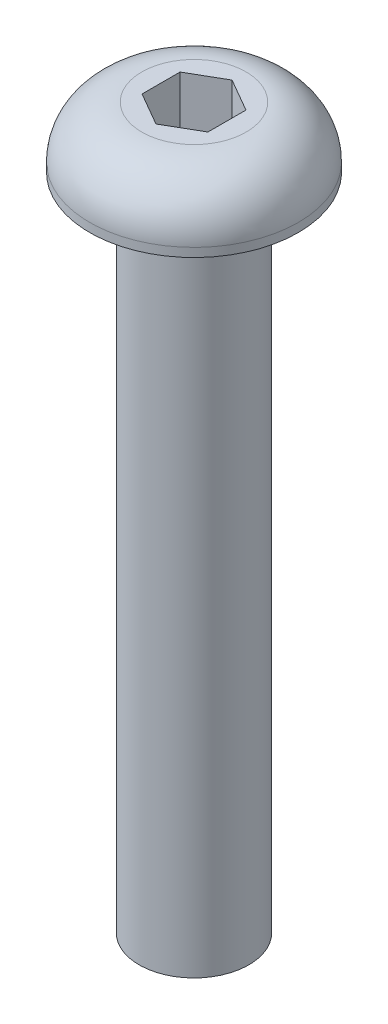
ISO-10303-21;
HEADER;
FILE_DESCRIPTION(('STEP AP214'),'2;1');
FILE_NAME('part.step','',(''),(''),'','','');
FILE_SCHEMA(('AUTOMOTIVE_DESIGN { 1 0 10303 214 1 1 1 1 }'));
ENDSEC;
DATA;
#1=APPLICATION_CONTEXT('core data for automotive mechanical design processes');
#2=APPLICATION_PROTOCOL_DEFINITION('international standard','automotive_design',2000,#1);
#3=PRODUCT_CONTEXT('',#1,'mechanical');
#4=PRODUCT('Part','Part','',(#3));
#5=PRODUCT_RELATED_PRODUCT_CATEGORY('part','',(#4));
#6=PRODUCT_DEFINITION_FORMATION('','',#4);
#7=PRODUCT_DEFINITION_CONTEXT('part definition',#1,'design');
#8=PRODUCT_DEFINITION('design','',#6,#7);
#9=PRODUCT_DEFINITION_SHAPE('','',#8);
#10=(LENGTH_UNIT() NAMED_UNIT(*) SI_UNIT(.MILLI.,.METRE.));
#11=(NAMED_UNIT(*) PLANE_ANGLE_UNIT() SI_UNIT($,.RADIAN.));
#12=(NAMED_UNIT(*) SI_UNIT($,.STERADIAN.) SOLID_ANGLE_UNIT());
#13=UNCERTAINTY_MEASURE_WITH_UNIT(LENGTH_MEASURE(1.E-05),#10,'distance_accuracy_value','');
#14=(GEOMETRIC_REPRESENTATION_CONTEXT(3) GLOBAL_UNCERTAINTY_ASSIGNED_CONTEXT((#13)) GLOBAL_UNIT_ASSIGNED_CONTEXT((#10,
#11,#12)) REPRESENTATION_CONTEXT('',''));
#15=CARTESIAN_POINT('',(0.,0.,0.));
#16=DIRECTION('',(0.,0.,1.));
#17=DIRECTION('',(1.,0.,0.));
#18=AXIS2_PLACEMENT_3D('',#15,#16,#17);
#19=CARTESIAN_POINT('',(2.375,32.775,0.));
#20=DIRECTION('',(0.,-1.,0.));
#21=DIRECTION('',(1.,0.,0.));
#22=AXIS2_PLACEMENT_3D('',#19,#20,#21);
#23=PLANE('',#22);
#24=DIRECTION('',(0.,0.,1.));
#25=VECTOR('',#24,1.);
#26=CARTESIAN_POINT('',(-1.5,32.775,-0.866025403784439));
#27=LINE('',#26,#25);
#28=CARTESIAN_POINT('',(-1.5,32.775,-0.866025403784439));
#29=VERTEX_POINT('',#28);
#30=CARTESIAN_POINT('',(-1.5,32.775,0.866025403784439));
#31=VERTEX_POINT('',#30);
#32=EDGE_CURVE('E121',#29,#31,#27,.T.);
#33=ORIENTED_EDGE('',*,*,#32,.F.);
#34=DIRECTION('',(-0.866025403784438,0.,0.5));
#35=VECTOR('',#34,1.);
#36=CARTESIAN_POINT('',(0.,32.775,-1.73205080756888));
#37=LINE('',#36,#35);
#38=CARTESIAN_POINT('',(0.,32.775,-1.73205080756888));
#39=VERTEX_POINT('',#38);
#40=EDGE_CURVE('E47',#39,#29,#37,.T.);
#41=ORIENTED_EDGE('',*,*,#40,.F.);
#42=DIRECTION('',(-0.866025403784439,0.,-0.5));
#43=VECTOR('',#42,1.);
#44=CARTESIAN_POINT('',(1.5,32.775,-0.866025403784439));
#45=LINE('',#44,#43);
#46=CARTESIAN_POINT('',(1.5,32.775,-0.866025403784439));
#47=VERTEX_POINT('',#46);
#48=EDGE_CURVE('E130',#47,#39,#45,.T.);
#49=ORIENTED_EDGE('',*,*,#48,.F.);
#50=DIRECTION('',(0.,0.,-1.));
#51=VECTOR('',#50,1.);
#52=CARTESIAN_POINT('',(1.5,32.775,0.866025403784438));
#53=LINE('',#52,#51);
#54=CARTESIAN_POINT('',(1.5,32.775,0.866025403784438));
#55=VERTEX_POINT('',#54);
#56=EDGE_CURVE('E128',#55,#47,#53,.T.);
#57=ORIENTED_EDGE('',*,*,#56,.F.);
#58=DIRECTION('',(0.866025403784439,0.,-0.5));
#59=VECTOR('',#58,1.);
#60=CARTESIAN_POINT('',(0.,32.775,1.73205080756888));
#61=LINE('',#60,#59);
#62=CARTESIAN_POINT('',(0.,32.775,1.73205080756888));
#63=VERTEX_POINT('',#62);
#64=EDGE_CURVE('E95',#63,#55,#61,.T.);
#65=ORIENTED_EDGE('',*,*,#64,.F.);
#66=DIRECTION('',(0.866025403784439,0.,0.5));
#67=VECTOR('',#66,1.);
#68=CARTESIAN_POINT('',(-1.5,32.775,0.866025403784439));
#69=LINE('',#68,#67);
#70=EDGE_CURVE('E124',#31,#63,#69,.T.);
#71=ORIENTED_EDGE('',*,*,#70,.F.);
#72=EDGE_LOOP('',(#33,#41,#49,#57,#65,#71));
#73=FACE_BOUND('',#72,.T.);
#74=CARTESIAN_POINT('',(0.,32.775,0.));
#75=DIRECTION('',(0.,1.,0.));
#76=DIRECTION('',(-1.,0.,0.));
#77=AXIS2_PLACEMENT_3D('',#74,#75,#76);
#78=CIRCLE('',#77,2.375);
#79=CARTESIAN_POINT('',(-2.37500000000001,32.775,0.));
#80=VERTEX_POINT('',#79);
#81=EDGE_CURVE('E11',#80,#80,#78,.T.);
#82=ORIENTED_EDGE('',*,*,#81,.T.);
#83=EDGE_LOOP('',(#82));
#84=FACE_BOUND('',#83,.T.);
#85=ADVANCED_FACE('F33',(#73,#84),#23,.F.);
#86=CARTESIAN_POINT('',(0.,30.4,0.));
#87=DIRECTION('',(0.,1.,0.));
#88=DIRECTION('',(-1.,0.,0.));
#89=AXIS2_PLACEMENT_3D('',#86,#87,#88);
#90=TOROIDAL_SURFACE('',#89,2.375,2.375);
#91=ORIENTED_EDGE('',*,*,#81,.F.);
#92=EDGE_LOOP('',(#91));
#93=FACE_BOUND('',#92,.T.);
#94=CARTESIAN_POINT('',(0.,30.4,0.));
#95=DIRECTION('',(0.,1.,0.));
#96=DIRECTION('',(-1.,0.,0.));
#97=AXIS2_PLACEMENT_3D('',#94,#95,#96);
#98=CIRCLE('',#97,4.75);
#99=CARTESIAN_POINT('',(-4.75000000000001,30.4,0.));
#100=VERTEX_POINT('',#99);
#101=EDGE_CURVE('E40',#100,#100,#98,.T.);
#102=ORIENTED_EDGE('',*,*,#101,.T.);
#103=EDGE_LOOP('',(#102));
#104=FACE_BOUND('',#103,.T.);
#105=ADVANCED_FACE('F150',(#93,#104),#90,.T.);
#106=CARTESIAN_POINT('',(0.,32.775,0.));
#107=DIRECTION('',(0.,1.,0.));
#108=DIRECTION('',(-1.,0.,0.));
#109=AXIS2_PLACEMENT_3D('',#106,#107,#108);
#110=CYLINDRICAL_SURFACE('',#109,4.75);
#111=ORIENTED_EDGE('',*,*,#101,.F.);
#112=EDGE_LOOP('',(#111));
#113=FACE_BOUND('',#112,.T.);
#114=CARTESIAN_POINT('',(0.,30.,0.));
#115=DIRECTION('',(0.,1.,0.));
#116=DIRECTION('',(-1.,0.,0.));
#117=AXIS2_PLACEMENT_3D('',#114,#115,#116);
#118=CIRCLE('',#117,4.75);
#119=CARTESIAN_POINT('',(-4.75000000000001,30.,0.));
#120=VERTEX_POINT('',#119);
#121=EDGE_CURVE('E145',#120,#120,#118,.T.);
#122=ORIENTED_EDGE('',*,*,#121,.T.);
#123=EDGE_LOOP('',(#122));
#124=FACE_BOUND('',#123,.T.);
#125=ADVANCED_FACE('F152',(#113,#124),#110,.T.);
#126=CARTESIAN_POINT('',(2.5,30.,0.));
#127=DIRECTION('',(0.,1.,0.));
#128=DIRECTION('',(-1.,0.,0.));
#129=AXIS2_PLACEMENT_3D('',#126,#127,#128);
#130=PLANE('',#129);
#131=ORIENTED_EDGE('',*,*,#121,.F.);
#132=EDGE_LOOP('',(#131));
#133=FACE_BOUND('',#132,.T.);
#134=CARTESIAN_POINT('',(0.,30.,0.));
#135=DIRECTION('',(0.,1.,0.));
#136=DIRECTION('',(-1.,0.,0.));
#137=AXIS2_PLACEMENT_3D('',#134,#135,#136);
#138=CIRCLE('',#137,2.5);
#139=CARTESIAN_POINT('',(-2.50000000000001,30.,0.));
#140=VERTEX_POINT('',#139);
#141=EDGE_CURVE('E142',#140,#140,#138,.T.);
#142=ORIENTED_EDGE('',*,*,#141,.T.);
#143=EDGE_LOOP('',(#142));
#144=FACE_BOUND('',#143,.T.);
#145=ADVANCED_FACE('F155',(#133,#144),#130,.F.);
#146=CARTESIAN_POINT('',(0.,32.775,0.));
#147=DIRECTION('',(0.,1.,0.));
#148=DIRECTION('',(-1.,0.,0.));
#149=AXIS2_PLACEMENT_3D('',#146,#147,#148);
#150=CYLINDRICAL_SURFACE('',#149,2.5);
#151=ORIENTED_EDGE('',*,*,#141,.F.);
#152=EDGE_LOOP('',(#151));
#153=FACE_BOUND('',#152,.T.);
#154=CARTESIAN_POINT('',(0.,0.,0.));
#155=DIRECTION('',(0.,1.,0.));
#156=DIRECTION('',(-1.,0.,0.));
#157=AXIS2_PLACEMENT_3D('',#154,#155,#156);
#158=CIRCLE('',#157,2.5);
#159=CARTESIAN_POINT('',(-2.5,0.,0.));
#160=VERTEX_POINT('',#159);
#161=EDGE_CURVE('E134',#160,#160,#158,.T.);
#162=ORIENTED_EDGE('',*,*,#161,.T.);
#163=EDGE_LOOP('',(#162));
#164=FACE_BOUND('',#163,.T.);
#165=ADVANCED_FACE('F161',(#153,#164),#150,.T.);
#166=CARTESIAN_POINT('',(0.,0.,0.));
#167=DIRECTION('',(0.,1.,0.));
#168=DIRECTION('',(-1.,0.,0.));
#169=AXIS2_PLACEMENT_3D('',#166,#167,#168);
#170=PLANE('',#169);
#171=ORIENTED_EDGE('',*,*,#161,.F.);
#172=EDGE_LOOP('',(#171));
#173=FACE_BOUND('',#172,.T.);
#174=ADVANCED_FACE('F167',(#173),#170,.F.);
#175=CARTESIAN_POINT('',(0.,28.775,-1.73205080756888));
#176=DIRECTION('',(-0.5,0.,-0.866025403784439));
#177=DIRECTION('',(-0.866025403784438,0.,0.5));
#178=AXIS2_PLACEMENT_3D('',#175,#176,#177);
#179=PLANE('',#178);
#180=ORIENTED_EDGE('',*,*,#40,.T.);
#181=DIRECTION('',(0.,1.,0.));
#182=VECTOR('',#181,1.);
#183=CARTESIAN_POINT('',(-1.5,28.775,-0.866025403784439));
#184=LINE('',#183,#182);
#185=CARTESIAN_POINT('',(-1.5,28.775,-0.866025403784439));
#186=VERTEX_POINT('',#185);
#187=EDGE_CURVE('E77',#186,#29,#184,.T.);
#188=ORIENTED_EDGE('',*,*,#187,.F.);
#189=DIRECTION('',(-0.866025403784438,0.,0.5));
#190=VECTOR('',#189,1.);
#191=CARTESIAN_POINT('',(0.,28.775,-1.73205080756888));
#192=LINE('',#191,#190);
#193=CARTESIAN_POINT('',(0.,28.775,-1.73205080756888));
#194=VERTEX_POINT('',#193);
#195=EDGE_CURVE('E132',#194,#186,#192,.T.);
#196=ORIENTED_EDGE('',*,*,#195,.F.);
#197=DIRECTION('',(0.,1.,0.));
#198=VECTOR('',#197,1.);
#199=CARTESIAN_POINT('',(0.,28.775,-1.73205080756888));
#200=LINE('',#199,#198);
#201=EDGE_CURVE('E55',#194,#39,#200,.T.);
#202=ORIENTED_EDGE('',*,*,#201,.T.);
#203=EDGE_LOOP('',(#180,#188,#196,#202));
#204=FACE_BOUND('',#203,.T.);
#205=ADVANCED_FACE('F172',(#204),#179,.F.);
#206=CARTESIAN_POINT('',(1.5,28.775,-0.866025403784439));
#207=DIRECTION('',(0.5,0.,-0.866025403784439));
#208=DIRECTION('',(-0.866025403784439,0.,-0.5));
#209=AXIS2_PLACEMENT_3D('',#206,#207,#208);
#210=PLANE('',#209);
#211=ORIENTED_EDGE('',*,*,#48,.T.);
#212=ORIENTED_EDGE('',*,*,#201,.F.);
#213=DIRECTION('',(-0.866025403784439,0.,-0.5));
#214=VECTOR('',#213,1.);
#215=CARTESIAN_POINT('',(1.5,28.775,-0.866025403784439));
#216=LINE('',#215,#214);
#217=CARTESIAN_POINT('',(1.5,28.775,-0.866025403784439));
#218=VERTEX_POINT('',#217);
#219=EDGE_CURVE('E107',#218,#194,#216,.T.);
#220=ORIENTED_EDGE('',*,*,#219,.F.);
#221=DIRECTION('',(0.,1.,0.));
#222=VECTOR('',#221,1.);
#223=CARTESIAN_POINT('',(1.5,28.775,-0.866025403784439));
#224=LINE('',#223,#222);
#225=EDGE_CURVE('E99',#218,#47,#224,.T.);
#226=ORIENTED_EDGE('',*,*,#225,.T.);
#227=EDGE_LOOP('',(#211,#212,#220,#226));
#228=FACE_BOUND('',#227,.T.);
#229=ADVANCED_FACE('F177',(#228),#210,.F.);
#230=CARTESIAN_POINT('',(1.5,28.775,0.866025403784438));
#231=DIRECTION('',(1.,0.,0.));
#232=DIRECTION('',(0.,1.,0.));
#233=AXIS2_PLACEMENT_3D('',#230,#231,#232);
#234=PLANE('',#233);
#235=ORIENTED_EDGE('',*,*,#56,.T.);
#236=ORIENTED_EDGE('',*,*,#225,.F.);
#237=DIRECTION('',(0.,0.,-1.));
#238=VECTOR('',#237,1.);
#239=CARTESIAN_POINT('',(1.5,28.775,0.866025403784438));
#240=LINE('',#239,#238);
#241=CARTESIAN_POINT('',(1.5,28.775,0.866025403784438));
#242=VERTEX_POINT('',#241);
#243=EDGE_CURVE('E103',#242,#218,#240,.T.);
#244=ORIENTED_EDGE('',*,*,#243,.F.);
#245=DIRECTION('',(0.,1.,0.));
#246=VECTOR('',#245,1.);
#247=CARTESIAN_POINT('',(1.5,28.775,0.866025403784438));
#248=LINE('',#247,#246);
#249=EDGE_CURVE('E88',#242,#55,#248,.T.);
#250=ORIENTED_EDGE('',*,*,#249,.T.);
#251=EDGE_LOOP('',(#235,#236,#244,#250));
#252=FACE_BOUND('',#251,.T.);
#253=ADVANCED_FACE('F104',(#252),#234,.F.);
#254=CARTESIAN_POINT('',(0.,28.775,1.73205080756888));
#255=DIRECTION('',(0.5,0.,0.866025403784439));
#256=DIRECTION('',(0.866025403784439,0.,-0.5));
#257=AXIS2_PLACEMENT_3D('',#254,#255,#256);
#258=PLANE('',#257);
#259=ORIENTED_EDGE('',*,*,#64,.T.);
#260=ORIENTED_EDGE('',*,*,#249,.F.);
#261=DIRECTION('',(0.866025403784439,0.,-0.5));
#262=VECTOR('',#261,1.);
#263=CARTESIAN_POINT('',(0.,28.775,1.73205080756888));
#264=LINE('',#263,#262);
#265=CARTESIAN_POINT('',(0.,28.775,1.73205080756888));
#266=VERTEX_POINT('',#265);
#267=EDGE_CURVE('E92',#266,#242,#264,.T.);
#268=ORIENTED_EDGE('',*,*,#267,.F.);
#269=DIRECTION('',(0.,1.,0.));
#270=VECTOR('',#269,1.);
#271=CARTESIAN_POINT('',(0.,28.775,1.73205080756888));
#272=LINE('',#271,#270);
#273=EDGE_CURVE('E100',#266,#63,#272,.T.);
#274=ORIENTED_EDGE('',*,*,#273,.T.);
#275=EDGE_LOOP('',(#259,#260,#268,#274));
#276=FACE_BOUND('',#275,.T.);
#277=ADVANCED_FACE('F90',(#276),#258,.F.);
#278=CARTESIAN_POINT('',(-1.5,28.775,0.866025403784439));
#279=DIRECTION('',(-0.5,0.,0.866025403784439));
#280=DIRECTION('',(0.866025403784439,0.,0.5));
#281=AXIS2_PLACEMENT_3D('',#278,#279,#280);
#282=PLANE('',#281);
#283=ORIENTED_EDGE('',*,*,#70,.T.);
#284=ORIENTED_EDGE('',*,*,#273,.F.);
#285=DIRECTION('',(0.866025403784439,0.,0.5));
#286=VECTOR('',#285,1.);
#287=CARTESIAN_POINT('',(-1.5,28.775,0.866025403784439));
#288=LINE('',#287,#286);
#289=CARTESIAN_POINT('',(-1.5,28.775,0.866025403784439));
#290=VERTEX_POINT('',#289);
#291=EDGE_CURVE('E113',#290,#266,#288,.T.);
#292=ORIENTED_EDGE('',*,*,#291,.F.);
#293=DIRECTION('',(0.,1.,0.));
#294=VECTOR('',#293,1.);
#295=CARTESIAN_POINT('',(-1.5,28.775,0.866025403784439));
#296=LINE('',#295,#294);
#297=EDGE_CURVE('E137',#290,#31,#296,.T.);
#298=ORIENTED_EDGE('',*,*,#297,.T.);
#299=EDGE_LOOP('',(#283,#284,#292,#298));
#300=FACE_BOUND('',#299,.T.);
#301=ADVANCED_FACE('F203',(#300),#282,.F.);
#302=CARTESIAN_POINT('',(-1.5,28.775,-0.866025403784439));
#303=DIRECTION('',(-1.,0.,0.));
#304=DIRECTION('',(0.,-1.,0.));
#305=AXIS2_PLACEMENT_3D('',#302,#303,#304);
#306=PLANE('',#305);
#307=ORIENTED_EDGE('',*,*,#32,.T.);
#308=ORIENTED_EDGE('',*,*,#297,.F.);
#309=DIRECTION('',(0.,0.,1.));
#310=VECTOR('',#309,1.);
#311=CARTESIAN_POINT('',(-1.5,28.775,-0.866025403784439));
#312=LINE('',#311,#310);
#313=EDGE_CURVE('E115',#186,#290,#312,.T.);
#314=ORIENTED_EDGE('',*,*,#313,.F.);
#315=ORIENTED_EDGE('',*,*,#187,.T.);
#316=EDGE_LOOP('',(#307,#308,#314,#315));
#317=FACE_BOUND('',#316,.T.);
#318=ADVANCED_FACE('F191',(#317),#306,.F.);
#319=CARTESIAN_POINT('',(0.,28.775,0.));
#320=DIRECTION('',(0.,1.,0.));
#321=DIRECTION('',(0.,0.,1.));
#322=AXIS2_PLACEMENT_3D('',#319,#320,#321);
#323=PLANE('',#322);
#324=ORIENTED_EDGE('',*,*,#195,.T.);
#325=ORIENTED_EDGE('',*,*,#313,.T.);
#326=ORIENTED_EDGE('',*,*,#291,.T.);
#327=ORIENTED_EDGE('',*,*,#267,.T.);
#328=ORIENTED_EDGE('',*,*,#243,.T.);
#329=ORIENTED_EDGE('',*,*,#219,.T.);
#330=EDGE_LOOP('',(#324,#325,#326,#327,#328,#329));
#331=FACE_BOUND('',#330,.T.);
#332=ADVANCED_FACE('F110',(#331),#323,.T.);
#333=CLOSED_SHELL('',(#85,#105,#125,#145,#165,#174,#205,#229,#253,#277,#301,#318,#332));
#334=MANIFOLD_SOLID_BREP('B2',#333);
#335=ADVANCED_BREP_SHAPE_REPRESENTATION('',(#18,#334),#14);
#336=SHAPE_DEFINITION_REPRESENTATION(#9,#335);
ENDSEC;
END-ISO-10303-21;
